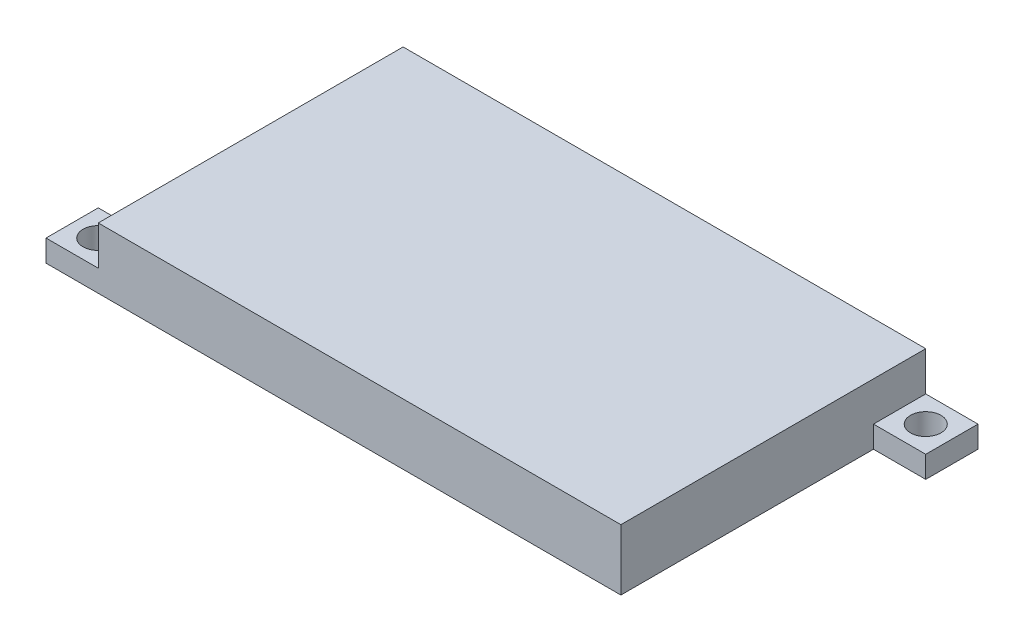
ISO-10303-21;
HEADER;
FILE_DESCRIPTION(('STEP AP214'),'2;1');
FILE_NAME('part.step','',(''),(''),'','','');
FILE_SCHEMA(('AUTOMOTIVE_DESIGN { 1 0 10303 214 1 1 1 1 }'));
ENDSEC;
DATA;
#1=APPLICATION_CONTEXT('core data for automotive mechanical design processes');
#2=APPLICATION_PROTOCOL_DEFINITION('international standard','automotive_design',2000,#1);
#3=PRODUCT_CONTEXT('',#1,'mechanical');
#4=PRODUCT('Part','Part','',(#3));
#5=PRODUCT_RELATED_PRODUCT_CATEGORY('part','',(#4));
#6=PRODUCT_DEFINITION_FORMATION('','',#4);
#7=PRODUCT_DEFINITION_CONTEXT('part definition',#1,'design');
#8=PRODUCT_DEFINITION('design','',#6,#7);
#9=PRODUCT_DEFINITION_SHAPE('','',#8);
#10=(LENGTH_UNIT() NAMED_UNIT(*) SI_UNIT(.MILLI.,.METRE.));
#11=(NAMED_UNIT(*) PLANE_ANGLE_UNIT() SI_UNIT($,.RADIAN.));
#12=(NAMED_UNIT(*) SI_UNIT($,.STERADIAN.) SOLID_ANGLE_UNIT());
#13=UNCERTAINTY_MEASURE_WITH_UNIT(LENGTH_MEASURE(1.E-05),#10,'distance_accuracy_value','');
#14=(GEOMETRIC_REPRESENTATION_CONTEXT(3) GLOBAL_UNCERTAINTY_ASSIGNED_CONTEXT((#13)) GLOBAL_UNIT_ASSIGNED_CONTEXT((#10,
#11,#12)) REPRESENTATION_CONTEXT('',''));
#15=CARTESIAN_POINT('',(0.,0.,0.));
#16=DIRECTION('',(0.,0.,1.));
#17=DIRECTION('',(1.,0.,0.));
#18=AXIS2_PLACEMENT_3D('',#15,#16,#17);
#19=CARTESIAN_POINT('',(30.,7.,-17.5));
#20=DIRECTION('',(-1.,0.,0.));
#21=DIRECTION('',(0.,0.,1.));
#22=AXIS2_PLACEMENT_3D('',#19,#20,#21);
#23=PLANE('',#22);
#24=DIRECTION('',(0.,-1.,0.));
#25=VECTOR('',#24,1.);
#26=CARTESIAN_POINT('',(30.,2.5,-11.5));
#27=LINE('',#26,#25);
#28=CARTESIAN_POINT('',(30.,2.5,-11.5));
#29=VERTEX_POINT('',#28);
#30=CARTESIAN_POINT('',(30.,0.,-11.5));
#31=VERTEX_POINT('',#30);
#32=EDGE_CURVE('E214',#29,#31,#27,.T.);
#33=ORIENTED_EDGE('',*,*,#32,.F.);
#34=DIRECTION('',(0.,0.,1.));
#35=VECTOR('',#34,1.);
#36=CARTESIAN_POINT('',(30.,2.5,-11.5));
#37=LINE('',#36,#35);
#38=CARTESIAN_POINT('',(30.,2.5,-17.5));
#39=VERTEX_POINT('',#38);
#40=EDGE_CURVE('E62',#39,#29,#37,.T.);
#41=ORIENTED_EDGE('',*,*,#40,.F.);
#42=DIRECTION('',(0.,-1.,0.));
#43=VECTOR('',#42,1.);
#44=CARTESIAN_POINT('',(30.,7.,-17.5));
#45=LINE('',#44,#43);
#46=CARTESIAN_POINT('',(30.,7.,-17.5));
#47=VERTEX_POINT('',#46);
#48=EDGE_CURVE('E303',#47,#39,#45,.T.);
#49=ORIENTED_EDGE('',*,*,#48,.F.);
#50=DIRECTION('',(0.,0.,-1.));
#51=VECTOR('',#50,1.);
#52=CARTESIAN_POINT('',(30.,7.,-17.5));
#53=LINE('',#52,#51);
#54=CARTESIAN_POINT('',(30.,7.,17.5));
#55=VERTEX_POINT('',#54);
#56=EDGE_CURVE('E283',#55,#47,#53,.T.);
#57=ORIENTED_EDGE('',*,*,#56,.F.);
#58=DIRECTION('',(0.,-1.,0.));
#59=VECTOR('',#58,1.);
#60=CARTESIAN_POINT('',(30.,7.,17.5));
#61=LINE('',#60,#59);
#62=CARTESIAN_POINT('',(30.,0.,17.5));
#63=VERTEX_POINT('',#62);
#64=EDGE_CURVE('E47',#55,#63,#61,.T.);
#65=ORIENTED_EDGE('',*,*,#64,.T.);
#66=DIRECTION('',(0.,0.,-1.));
#67=VECTOR('',#66,1.);
#68=CARTESIAN_POINT('',(30.,0.,-17.5));
#69=LINE('',#68,#67);
#70=EDGE_CURVE('E295',#63,#31,#69,.T.);
#71=ORIENTED_EDGE('',*,*,#70,.T.);
#72=EDGE_LOOP('',(#33,#41,#49,#57,#65,#71));
#73=FACE_BOUND('',#72,.T.);
#74=ADVANCED_FACE('F38',(#73),#23,.F.);
#75=CARTESIAN_POINT('',(-30.,7.,-17.5));
#76=DIRECTION('',(1.,0.,0.));
#77=DIRECTION('',(0.,0.,-1.));
#78=AXIS2_PLACEMENT_3D('',#75,#76,#77);
#79=PLANE('',#78);
#80=DIRECTION('',(0.,-1.,0.));
#81=VECTOR('',#80,1.);
#82=CARTESIAN_POINT('',(-30.,2.5,11.5));
#83=LINE('',#82,#81);
#84=CARTESIAN_POINT('',(-30.,2.5,11.5));
#85=VERTEX_POINT('',#84);
#86=CARTESIAN_POINT('',(-30.,0.,11.5));
#87=VERTEX_POINT('',#86);
#88=EDGE_CURVE('E266',#85,#87,#83,.T.);
#89=ORIENTED_EDGE('',*,*,#88,.F.);
#90=DIRECTION('',(0.,0.,-1.));
#91=VECTOR('',#90,1.);
#92=CARTESIAN_POINT('',(-30.,2.5,11.5));
#93=LINE('',#92,#91);
#94=CARTESIAN_POINT('',(-30.,2.5,17.5));
#95=VERTEX_POINT('',#94);
#96=EDGE_CURVE('E250',#95,#85,#93,.T.);
#97=ORIENTED_EDGE('',*,*,#96,.F.);
#98=DIRECTION('',(0.,-1.,0.));
#99=VECTOR('',#98,1.);
#100=CARTESIAN_POINT('',(-30.,7.,17.5));
#101=LINE('',#100,#99);
#102=CARTESIAN_POINT('',(-30.,7.,17.5));
#103=VERTEX_POINT('',#102);
#104=EDGE_CURVE('E11',#103,#95,#101,.T.);
#105=ORIENTED_EDGE('',*,*,#104,.F.);
#106=DIRECTION('',(0.,0.,1.));
#107=VECTOR('',#106,1.);
#108=CARTESIAN_POINT('',(-30.,7.,-17.5));
#109=LINE('',#108,#107);
#110=CARTESIAN_POINT('',(-30.,7.,-17.5));
#111=VERTEX_POINT('',#110);
#112=EDGE_CURVE('E275',#111,#103,#109,.T.);
#113=ORIENTED_EDGE('',*,*,#112,.F.);
#114=DIRECTION('',(0.,-1.,0.));
#115=VECTOR('',#114,1.);
#116=CARTESIAN_POINT('',(-30.,7.,-17.5));
#117=LINE('',#116,#115);
#118=CARTESIAN_POINT('',(-30.,0.,-17.5));
#119=VERTEX_POINT('',#118);
#120=EDGE_CURVE('E289',#111,#119,#117,.T.);
#121=ORIENTED_EDGE('',*,*,#120,.T.);
#122=DIRECTION('',(0.,0.,1.));
#123=VECTOR('',#122,1.);
#124=CARTESIAN_POINT('',(-30.,0.,-17.5));
#125=LINE('',#124,#123);
#126=EDGE_CURVE('E274',#119,#87,#125,.T.);
#127=ORIENTED_EDGE('',*,*,#126,.T.);
#128=EDGE_LOOP('',(#89,#97,#105,#113,#121,#127));
#129=FACE_BOUND('',#128,.T.);
#130=ADVANCED_FACE('F40',(#129),#79,.F.);
#131=CARTESIAN_POINT('',(30.,7.,17.5));
#132=DIRECTION('',(0.,0.,-1.));
#133=DIRECTION('',(-1.,0.,0.));
#134=AXIS2_PLACEMENT_3D('',#131,#132,#133);
#135=PLANE('',#134);
#136=DIRECTION('',(1.,0.,0.));
#137=VECTOR('',#136,1.);
#138=CARTESIAN_POINT('',(30.,0.,17.5));
#139=LINE('',#138,#137);
#140=CARTESIAN_POINT('',(-36.,0.,17.5));
#141=VERTEX_POINT('',#140);
#142=EDGE_CURVE('E292',#141,#63,#139,.T.);
#143=ORIENTED_EDGE('',*,*,#142,.T.);
#144=ORIENTED_EDGE('',*,*,#64,.F.);
#145=DIRECTION('',(1.,0.,0.));
#146=VECTOR('',#145,1.);
#147=CARTESIAN_POINT('',(30.,7.,17.5));
#148=LINE('',#147,#146);
#149=EDGE_CURVE('E279',#103,#55,#148,.T.);
#150=ORIENTED_EDGE('',*,*,#149,.F.);
#151=ORIENTED_EDGE('',*,*,#104,.T.);
#152=DIRECTION('',(1.,0.,0.));
#153=VECTOR('',#152,1.);
#154=CARTESIAN_POINT('',(-30.,2.5,17.5));
#155=LINE('',#154,#153);
#156=CARTESIAN_POINT('',(-36.,2.5,17.5));
#157=VERTEX_POINT('',#156);
#158=EDGE_CURVE('E245',#157,#95,#155,.T.);
#159=ORIENTED_EDGE('',*,*,#158,.F.);
#160=DIRECTION('',(0.,-1.,0.));
#161=VECTOR('',#160,1.);
#162=CARTESIAN_POINT('',(-36.,2.5,17.5));
#163=LINE('',#162,#161);
#164=EDGE_CURVE('E270',#157,#141,#163,.T.);
#165=ORIENTED_EDGE('',*,*,#164,.T.);
#166=EDGE_LOOP('',(#143,#144,#150,#151,#159,#165));
#167=FACE_BOUND('',#166,.T.);
#168=ADVANCED_FACE('F334',(#167),#135,.F.);
#169=CARTESIAN_POINT('',(30.,7.,-17.5));
#170=DIRECTION('',(0.,0.,1.));
#171=DIRECTION('',(1.,0.,0.));
#172=AXIS2_PLACEMENT_3D('',#169,#170,#171);
#173=PLANE('',#172);
#174=DIRECTION('',(-1.,0.,0.));
#175=VECTOR('',#174,1.);
#176=CARTESIAN_POINT('',(30.,0.,-17.5));
#177=LINE('',#176,#175);
#178=CARTESIAN_POINT('',(36.,0.,-17.5));
#179=VERTEX_POINT('',#178);
#180=EDGE_CURVE('E280',#179,#119,#177,.T.);
#181=ORIENTED_EDGE('',*,*,#180,.T.);
#182=ORIENTED_EDGE('',*,*,#120,.F.);
#183=DIRECTION('',(-1.,0.,0.));
#184=VECTOR('',#183,1.);
#185=CARTESIAN_POINT('',(30.,7.,-17.5));
#186=LINE('',#185,#184);
#187=EDGE_CURVE('E286',#47,#111,#186,.T.);
#188=ORIENTED_EDGE('',*,*,#187,.F.);
#189=ORIENTED_EDGE('',*,*,#48,.T.);
#190=DIRECTION('',(-1.,0.,0.));
#191=VECTOR('',#190,1.);
#192=CARTESIAN_POINT('',(30.,2.5,-17.5));
#193=LINE('',#192,#191);
#194=CARTESIAN_POINT('',(36.,2.5,-17.5));
#195=VERTEX_POINT('',#194);
#196=EDGE_CURVE('E208',#195,#39,#193,.T.);
#197=ORIENTED_EDGE('',*,*,#196,.F.);
#198=DIRECTION('',(0.,-1.,0.));
#199=VECTOR('',#198,1.);
#200=CARTESIAN_POINT('',(36.,2.5,-17.5));
#201=LINE('',#200,#199);
#202=EDGE_CURVE('E224',#195,#179,#201,.T.);
#203=ORIENTED_EDGE('',*,*,#202,.T.);
#204=EDGE_LOOP('',(#181,#182,#188,#189,#197,#203));
#205=FACE_BOUND('',#204,.T.);
#206=ADVANCED_FACE('F327',(#205),#173,.F.);
#207=CARTESIAN_POINT('',(0.,7.,0.));
#208=DIRECTION('',(0.,-1.,0.));
#209=DIRECTION('',(0.,0.,-1.));
#210=AXIS2_PLACEMENT_3D('',#207,#208,#209);
#211=PLANE('',#210);
#212=ORIENTED_EDGE('',*,*,#112,.T.);
#213=ORIENTED_EDGE('',*,*,#149,.T.);
#214=ORIENTED_EDGE('',*,*,#56,.T.);
#215=ORIENTED_EDGE('',*,*,#187,.T.);
#216=EDGE_LOOP('',(#212,#213,#214,#215));
#217=FACE_BOUND('',#216,.T.);
#218=ADVANCED_FACE('F332',(#217),#211,.F.);
#219=CARTESIAN_POINT('',(0.,0.,0.));
#220=DIRECTION('',(0.,-1.,0.));
#221=DIRECTION('',(0.,0.,-1.));
#222=AXIS2_PLACEMENT_3D('',#219,#220,#221);
#223=PLANE('',#222);
#224=DIRECTION('',(0.,0.,1.));
#225=VECTOR('',#224,1.);
#226=CARTESIAN_POINT('',(27.5,0.,-15.5));
#227=LINE('',#226,#225);
#228=CARTESIAN_POINT('',(27.5,0.,-15.5));
#229=VERTEX_POINT('',#228);
#230=CARTESIAN_POINT('',(27.5,0.,15.5));
#231=VERTEX_POINT('',#230);
#232=EDGE_CURVE('E54',#229,#231,#227,.T.);
#233=ORIENTED_EDGE('',*,*,#232,.F.);
#234=DIRECTION('',(1.,0.,0.));
#235=VECTOR('',#234,1.);
#236=CARTESIAN_POINT('',(-27.5,0.,-15.5));
#237=LINE('',#236,#235);
#238=CARTESIAN_POINT('',(-27.5,0.,-15.5));
#239=VERTEX_POINT('',#238);
#240=EDGE_CURVE('E164',#239,#229,#237,.T.);
#241=ORIENTED_EDGE('',*,*,#240,.F.);
#242=DIRECTION('',(0.,0.,-1.));
#243=VECTOR('',#242,1.);
#244=CARTESIAN_POINT('',(-27.5,0.,-15.5));
#245=LINE('',#244,#243);
#246=CARTESIAN_POINT('',(-27.5,0.,15.5));
#247=VERTEX_POINT('',#246);
#248=EDGE_CURVE('E168',#247,#239,#245,.T.);
#249=ORIENTED_EDGE('',*,*,#248,.F.);
#250=DIRECTION('',(-1.,0.,0.));
#251=VECTOR('',#250,1.);
#252=CARTESIAN_POINT('',(-27.5,0.,15.5));
#253=LINE('',#252,#251);
#254=EDGE_CURVE('E177',#231,#247,#253,.T.);
#255=ORIENTED_EDGE('',*,*,#254,.F.);
#256=EDGE_LOOP('',(#233,#241,#249,#255));
#257=FACE_BOUND('',#256,.T.);
#258=ORIENTED_EDGE('',*,*,#126,.F.);
#259=ORIENTED_EDGE('',*,*,#180,.F.);
#260=DIRECTION('',(0.,0.,-1.));
#261=VECTOR('',#260,1.);
#262=CARTESIAN_POINT('',(36.,0.,-17.5));
#263=LINE('',#262,#261);
#264=CARTESIAN_POINT('',(36.,0.,-11.5));
#265=VERTEX_POINT('',#264);
#266=EDGE_CURVE('E205',#265,#179,#263,.T.);
#267=ORIENTED_EDGE('',*,*,#266,.F.);
#268=DIRECTION('',(1.,0.,0.));
#269=VECTOR('',#268,1.);
#270=CARTESIAN_POINT('',(36.,0.,-11.5));
#271=LINE('',#270,#269);
#272=EDGE_CURVE('E196',#31,#265,#271,.T.);
#273=ORIENTED_EDGE('',*,*,#272,.F.);
#274=ORIENTED_EDGE('',*,*,#70,.F.);
#275=ORIENTED_EDGE('',*,*,#142,.F.);
#276=DIRECTION('',(0.,0.,1.));
#277=VECTOR('',#276,1.);
#278=CARTESIAN_POINT('',(-36.,0.,17.5));
#279=LINE('',#278,#277);
#280=CARTESIAN_POINT('',(-36.,0.,11.5));
#281=VERTEX_POINT('',#280);
#282=EDGE_CURVE('E237',#281,#141,#279,.T.);
#283=ORIENTED_EDGE('',*,*,#282,.F.);
#284=DIRECTION('',(-1.,0.,0.));
#285=VECTOR('',#284,1.);
#286=CARTESIAN_POINT('',(-36.,0.,11.5));
#287=LINE('',#286,#285);
#288=EDGE_CURVE('E246',#87,#281,#287,.T.);
#289=ORIENTED_EDGE('',*,*,#288,.F.);
#290=EDGE_LOOP('',(#258,#259,#267,#273,#274,#275,#283,#289));
#291=FACE_BOUND('',#290,.T.);
#292=CARTESIAN_POINT('',(-33.,0.,14.5));
#293=DIRECTION('',(0.,1.,0.));
#294=DIRECTION('',(0.,0.,-1.));
#295=AXIS2_PLACEMENT_3D('',#292,#293,#294);
#296=CIRCLE('',#295,1.75);
#297=CARTESIAN_POINT('',(-33.,0.,12.75));
#298=VERTEX_POINT('',#297);
#299=EDGE_CURVE('E232',#298,#298,#296,.T.);
#300=ORIENTED_EDGE('',*,*,#299,.T.);
#301=EDGE_LOOP('',(#300));
#302=FACE_BOUND('',#301,.T.);
#303=CARTESIAN_POINT('',(33.,0.,-14.5));
#304=DIRECTION('',(0.,1.,0.));
#305=DIRECTION('',(0.,0.,-1.));
#306=AXIS2_PLACEMENT_3D('',#303,#304,#305);
#307=CIRCLE('',#306,1.75);
#308=CARTESIAN_POINT('',(33.,0.,-16.25));
#309=VERTEX_POINT('',#308);
#310=EDGE_CURVE('E186',#309,#309,#307,.T.);
#311=ORIENTED_EDGE('',*,*,#310,.T.);
#312=EDGE_LOOP('',(#311));
#313=FACE_BOUND('',#312,.T.);
#314=ADVANCED_FACE('F314',(#257,#291,#302,#313),#223,.T.);
#315=CARTESIAN_POINT('',(0.,2.5,0.));
#316=DIRECTION('',(0.,-1.,0.));
#317=DIRECTION('',(0.,0.,-1.));
#318=AXIS2_PLACEMENT_3D('',#315,#316,#317);
#319=PLANE('',#318);
#320=DIRECTION('',(0.,0.,1.));
#321=VECTOR('',#320,1.);
#322=CARTESIAN_POINT('',(-36.,2.5,17.5));
#323=LINE('',#322,#321);
#324=CARTESIAN_POINT('',(-36.,2.5,11.5));
#325=VERTEX_POINT('',#324);
#326=EDGE_CURVE('E241',#325,#157,#323,.T.);
#327=ORIENTED_EDGE('',*,*,#326,.T.);
#328=ORIENTED_EDGE('',*,*,#158,.T.);
#329=ORIENTED_EDGE('',*,*,#96,.T.);
#330=DIRECTION('',(-1.,0.,0.));
#331=VECTOR('',#330,1.);
#332=CARTESIAN_POINT('',(-36.,2.5,11.5));
#333=LINE('',#332,#331);
#334=EDGE_CURVE('E254',#85,#325,#333,.T.);
#335=ORIENTED_EDGE('',*,*,#334,.T.);
#336=EDGE_LOOP('',(#327,#328,#329,#335));
#337=FACE_BOUND('',#336,.T.);
#338=CARTESIAN_POINT('',(-33.,2.5,14.5));
#339=DIRECTION('',(0.,1.,0.));
#340=DIRECTION('',(0.,0.,-1.));
#341=AXIS2_PLACEMENT_3D('',#338,#339,#340);
#342=CIRCLE('',#341,1.75);
#343=CARTESIAN_POINT('',(-33.,2.5,12.75));
#344=VERTEX_POINT('',#343);
#345=EDGE_CURVE('E233',#344,#344,#342,.T.);
#346=ORIENTED_EDGE('',*,*,#345,.F.);
#347=EDGE_LOOP('',(#346));
#348=FACE_BOUND('',#347,.T.);
#349=ADVANCED_FACE('F337',(#337,#348),#319,.F.);
#350=CARTESIAN_POINT('',(-36.,2.5,17.5));
#351=DIRECTION('',(1.,0.,0.));
#352=DIRECTION('',(0.,0.,-1.));
#353=AXIS2_PLACEMENT_3D('',#350,#351,#352);
#354=PLANE('',#353);
#355=ORIENTED_EDGE('',*,*,#282,.T.);
#356=ORIENTED_EDGE('',*,*,#164,.F.);
#357=ORIENTED_EDGE('',*,*,#326,.F.);
#358=DIRECTION('',(0.,-1.,0.));
#359=VECTOR('',#358,1.);
#360=CARTESIAN_POINT('',(-36.,2.5,11.5));
#361=LINE('',#360,#359);
#362=EDGE_CURVE('E257',#325,#281,#361,.T.);
#363=ORIENTED_EDGE('',*,*,#362,.T.);
#364=EDGE_LOOP('',(#355,#356,#357,#363));
#365=FACE_BOUND('',#364,.T.);
#366=ADVANCED_FACE('F344',(#365),#354,.F.);
#367=CARTESIAN_POINT('',(-36.,2.5,11.5));
#368=DIRECTION('',(0.,0.,1.));
#369=DIRECTION('',(1.,0.,0.));
#370=AXIS2_PLACEMENT_3D('',#367,#368,#369);
#371=PLANE('',#370);
#372=ORIENTED_EDGE('',*,*,#288,.T.);
#373=ORIENTED_EDGE('',*,*,#362,.F.);
#374=ORIENTED_EDGE('',*,*,#334,.F.);
#375=ORIENTED_EDGE('',*,*,#88,.T.);
#376=EDGE_LOOP('',(#372,#373,#374,#375));
#377=FACE_BOUND('',#376,.T.);
#378=ADVANCED_FACE('F347',(#377),#371,.F.);
#379=CARTESIAN_POINT('',(-33.,2.5,14.5));
#380=DIRECTION('',(0.,-1.,0.));
#381=DIRECTION('',(0.,0.,-1.));
#382=AXIS2_PLACEMENT_3D('',#379,#380,#381);
#383=CYLINDRICAL_SURFACE('',#382,1.75);
#384=ORIENTED_EDGE('',*,*,#345,.T.);
#385=EDGE_LOOP('',(#384));
#386=FACE_BOUND('',#385,.T.);
#387=ORIENTED_EDGE('',*,*,#299,.F.);
#388=EDGE_LOOP('',(#387));
#389=FACE_BOUND('',#388,.T.);
#390=ADVANCED_FACE('F368',(#386,#389),#383,.F.);
#391=CARTESIAN_POINT('',(0.,2.5,0.));
#392=DIRECTION('',(0.,-1.,0.));
#393=DIRECTION('',(0.,0.,-1.));
#394=AXIS2_PLACEMENT_3D('',#391,#392,#393);
#395=PLANE('',#394);
#396=DIRECTION('',(1.,0.,0.));
#397=VECTOR('',#396,1.);
#398=CARTESIAN_POINT('',(36.,2.5,-11.5));
#399=LINE('',#398,#397);
#400=CARTESIAN_POINT('',(36.,2.5,-11.5));
#401=VERTEX_POINT('',#400);
#402=EDGE_CURVE('E200',#29,#401,#399,.T.);
#403=ORIENTED_EDGE('',*,*,#402,.T.);
#404=DIRECTION('',(0.,0.,-1.));
#405=VECTOR('',#404,1.);
#406=CARTESIAN_POINT('',(36.,2.5,-17.5));
#407=LINE('',#406,#405);
#408=EDGE_CURVE('E204',#401,#195,#407,.T.);
#409=ORIENTED_EDGE('',*,*,#408,.T.);
#410=ORIENTED_EDGE('',*,*,#196,.T.);
#411=ORIENTED_EDGE('',*,*,#40,.T.);
#412=EDGE_LOOP('',(#403,#409,#410,#411));
#413=FACE_BOUND('',#412,.T.);
#414=CARTESIAN_POINT('',(33.,2.5,-14.5));
#415=DIRECTION('',(0.,1.,0.));
#416=DIRECTION('',(0.,0.,-1.));
#417=AXIS2_PLACEMENT_3D('',#414,#415,#416);
#418=CIRCLE('',#417,1.75);
#419=CARTESIAN_POINT('',(33.,2.5,-16.25));
#420=VERTEX_POINT('',#419);
#421=EDGE_CURVE('E192',#420,#420,#418,.T.);
#422=ORIENTED_EDGE('',*,*,#421,.F.);
#423=EDGE_LOOP('',(#422));
#424=FACE_BOUND('',#423,.T.);
#425=ADVANCED_FACE('F322',(#413,#424),#395,.F.);
#426=CARTESIAN_POINT('',(36.,2.5,-11.5));
#427=DIRECTION('',(0.,0.,-1.));
#428=DIRECTION('',(-1.,0.,0.));
#429=AXIS2_PLACEMENT_3D('',#426,#427,#428);
#430=PLANE('',#429);
#431=ORIENTED_EDGE('',*,*,#272,.T.);
#432=DIRECTION('',(0.,-1.,0.));
#433=VECTOR('',#432,1.);
#434=CARTESIAN_POINT('',(36.,2.5,-11.5));
#435=LINE('',#434,#433);
#436=EDGE_CURVE('E228',#401,#265,#435,.T.);
#437=ORIENTED_EDGE('',*,*,#436,.F.);
#438=ORIENTED_EDGE('',*,*,#402,.F.);
#439=ORIENTED_EDGE('',*,*,#32,.T.);
#440=EDGE_LOOP('',(#431,#437,#438,#439));
#441=FACE_BOUND('',#440,.T.);
#442=ADVANCED_FACE('F319',(#441),#430,.F.);
#443=CARTESIAN_POINT('',(36.,2.5,-17.5));
#444=DIRECTION('',(-1.,0.,0.));
#445=DIRECTION('',(0.,0.,1.));
#446=AXIS2_PLACEMENT_3D('',#443,#444,#445);
#447=PLANE('',#446);
#448=ORIENTED_EDGE('',*,*,#266,.T.);
#449=ORIENTED_EDGE('',*,*,#202,.F.);
#450=ORIENTED_EDGE('',*,*,#408,.F.);
#451=ORIENTED_EDGE('',*,*,#436,.T.);
#452=EDGE_LOOP('',(#448,#449,#450,#451));
#453=FACE_BOUND('',#452,.T.);
#454=ADVANCED_FACE('F376',(#453),#447,.F.);
#455=CARTESIAN_POINT('',(33.,2.5,-14.5));
#456=DIRECTION('',(0.,-1.,0.));
#457=DIRECTION('',(0.,0.,-1.));
#458=AXIS2_PLACEMENT_3D('',#455,#456,#457);
#459=CYLINDRICAL_SURFACE('',#458,1.75);
#460=ORIENTED_EDGE('',*,*,#421,.T.);
#461=EDGE_LOOP('',(#460));
#462=FACE_BOUND('',#461,.T.);
#463=ORIENTED_EDGE('',*,*,#310,.F.);
#464=EDGE_LOOP('',(#463));
#465=FACE_BOUND('',#464,.T.);
#466=ADVANCED_FACE('F379',(#462,#465),#459,.F.);
#467=CARTESIAN_POINT('',(27.5,5.,-15.5));
#468=DIRECTION('',(1.,0.,0.));
#469=DIRECTION('',(0.,0.,-1.));
#470=AXIS2_PLACEMENT_3D('',#467,#468,#469);
#471=PLANE('',#470);
#472=ORIENTED_EDGE('',*,*,#232,.T.);
#473=DIRECTION('',(0.,-1.,0.));
#474=VECTOR('',#473,1.);
#475=CARTESIAN_POINT('',(27.5,5.,15.5));
#476=LINE('',#475,#474);
#477=CARTESIAN_POINT('',(27.5,5.,15.5));
#478=VERTEX_POINT('',#477);
#479=EDGE_CURVE('E139',#478,#231,#476,.T.);
#480=ORIENTED_EDGE('',*,*,#479,.F.);
#481=DIRECTION('',(0.,0.,1.));
#482=VECTOR('',#481,1.);
#483=CARTESIAN_POINT('',(27.5,5.,-15.5));
#484=LINE('',#483,#482);
#485=CARTESIAN_POINT('',(27.5,5.,-15.5));
#486=VERTEX_POINT('',#485);
#487=EDGE_CURVE('E143',#486,#478,#484,.T.);
#488=ORIENTED_EDGE('',*,*,#487,.F.);
#489=DIRECTION('',(0.,-1.,0.));
#490=VECTOR('',#489,1.);
#491=CARTESIAN_POINT('',(27.5,5.,-15.5));
#492=LINE('',#491,#490);
#493=EDGE_CURVE('E183',#486,#229,#492,.T.);
#494=ORIENTED_EDGE('',*,*,#493,.T.);
#495=EDGE_LOOP('',(#472,#480,#488,#494));
#496=FACE_BOUND('',#495,.T.);
#497=ADVANCED_FACE('F141',(#496),#471,.F.);
#498=CARTESIAN_POINT('',(-27.5,5.,-15.5));
#499=DIRECTION('',(0.,0.,-1.));
#500=DIRECTION('',(-1.,0.,0.));
#501=AXIS2_PLACEMENT_3D('',#498,#499,#500);
#502=PLANE('',#501);
#503=ORIENTED_EDGE('',*,*,#240,.T.);
#504=ORIENTED_EDGE('',*,*,#493,.F.);
#505=DIRECTION('',(1.,0.,0.));
#506=VECTOR('',#505,1.);
#507=CARTESIAN_POINT('',(-27.5,5.,-15.5));
#508=LINE('',#507,#506);
#509=CARTESIAN_POINT('',(-27.5,5.,-15.5));
#510=VERTEX_POINT('',#509);
#511=EDGE_CURVE('E150',#510,#486,#508,.T.);
#512=ORIENTED_EDGE('',*,*,#511,.F.);
#513=DIRECTION('',(0.,-1.,0.));
#514=VECTOR('',#513,1.);
#515=CARTESIAN_POINT('',(-27.5,5.,-15.5));
#516=LINE('',#515,#514);
#517=EDGE_CURVE('E187',#510,#239,#516,.T.);
#518=ORIENTED_EDGE('',*,*,#517,.T.);
#519=EDGE_LOOP('',(#503,#504,#512,#518));
#520=FACE_BOUND('',#519,.T.);
#521=ADVANCED_FACE('F388',(#520),#502,.F.);
#522=CARTESIAN_POINT('',(-27.5,5.,-15.5));
#523=DIRECTION('',(-1.,0.,0.));
#524=DIRECTION('',(0.,0.,1.));
#525=AXIS2_PLACEMENT_3D('',#522,#523,#524);
#526=PLANE('',#525);
#527=ORIENTED_EDGE('',*,*,#248,.T.);
#528=ORIENTED_EDGE('',*,*,#517,.F.);
#529=DIRECTION('',(0.,0.,-1.));
#530=VECTOR('',#529,1.);
#531=CARTESIAN_POINT('',(-27.5,5.,-15.5));
#532=LINE('',#531,#530);
#533=CARTESIAN_POINT('',(-27.5,5.,15.5));
#534=VERTEX_POINT('',#533);
#535=EDGE_CURVE('E159',#534,#510,#532,.T.);
#536=ORIENTED_EDGE('',*,*,#535,.F.);
#537=DIRECTION('',(0.,-1.,0.));
#538=VECTOR('',#537,1.);
#539=CARTESIAN_POINT('',(-27.5,5.,15.5));
#540=LINE('',#539,#538);
#541=EDGE_CURVE('E149',#534,#247,#540,.T.);
#542=ORIENTED_EDGE('',*,*,#541,.T.);
#543=EDGE_LOOP('',(#527,#528,#536,#542));
#544=FACE_BOUND('',#543,.T.);
#545=ADVANCED_FACE('F391',(#544),#526,.F.);
#546=CARTESIAN_POINT('',(-27.5,5.,15.5));
#547=DIRECTION('',(0.,0.,1.));
#548=DIRECTION('',(1.,0.,0.));
#549=AXIS2_PLACEMENT_3D('',#546,#547,#548);
#550=PLANE('',#549);
#551=ORIENTED_EDGE('',*,*,#254,.T.);
#552=ORIENTED_EDGE('',*,*,#541,.F.);
#553=DIRECTION('',(-1.,0.,0.));
#554=VECTOR('',#553,1.);
#555=CARTESIAN_POINT('',(-27.5,5.,15.5));
#556=LINE('',#555,#554);
#557=EDGE_CURVE('E153',#478,#534,#556,.T.);
#558=ORIENTED_EDGE('',*,*,#557,.F.);
#559=ORIENTED_EDGE('',*,*,#479,.T.);
#560=EDGE_LOOP('',(#551,#552,#558,#559));
#561=FACE_BOUND('',#560,.T.);
#562=ADVANCED_FACE('F154',(#561),#550,.F.);
#563=CARTESIAN_POINT('',(0.,5.,0.));
#564=DIRECTION('',(0.,1.,0.));
#565=DIRECTION('',(0.,0.,1.));
#566=AXIS2_PLACEMENT_3D('',#563,#564,#565);
#567=PLANE('',#566);
#568=ORIENTED_EDGE('',*,*,#487,.T.);
#569=ORIENTED_EDGE('',*,*,#557,.T.);
#570=ORIENTED_EDGE('',*,*,#535,.T.);
#571=ORIENTED_EDGE('',*,*,#511,.T.);
#572=EDGE_LOOP('',(#568,#569,#570,#571));
#573=FACE_BOUND('',#572,.T.);
#574=ADVANCED_FACE('F161',(#573),#567,.F.);
#575=CLOSED_SHELL('',(#74,#130,#168,#206,#218,#314,#349,#366,#378,#390,#425,#442,#454,#466,#497,
#521,#545,#562,#574));
#576=MANIFOLD_SOLID_BREP('B2',#575);
#577=ADVANCED_BREP_SHAPE_REPRESENTATION('',(#18,#576),#14);
#578=SHAPE_DEFINITION_REPRESENTATION(#9,#577);
ENDSEC;
END-ISO-10303-21;
